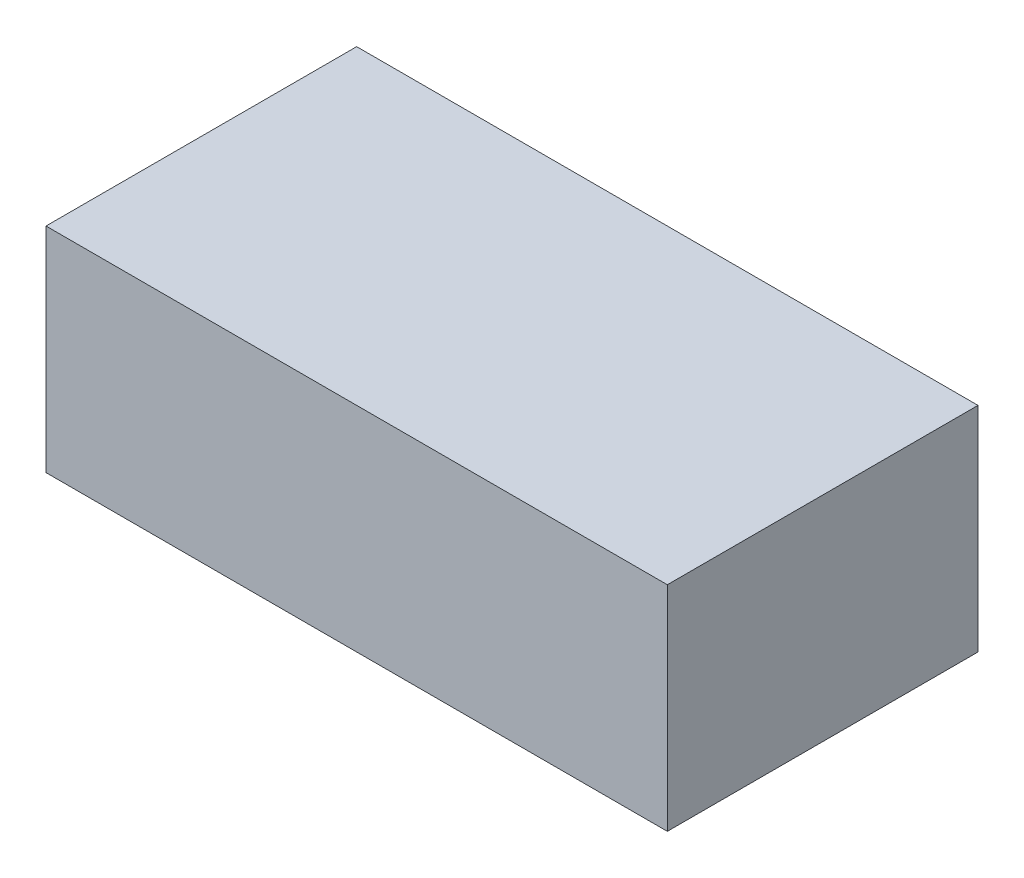
ISO-10303-21;
HEADER;
FILE_DESCRIPTION(('STEP AP214'),'2;1');
FILE_NAME('part.step','',(''),(''),'','','');
FILE_SCHEMA(('AUTOMOTIVE_DESIGN { 1 0 10303 214 1 1 1 1 }'));
ENDSEC;
DATA;
#1=APPLICATION_CONTEXT('core data for automotive mechanical design processes');
#2=APPLICATION_PROTOCOL_DEFINITION('international standard','automotive_design',2000,#1);
#3=PRODUCT_CONTEXT('',#1,'mechanical');
#4=PRODUCT('Part','Part','',(#3));
#5=PRODUCT_RELATED_PRODUCT_CATEGORY('part','',(#4));
#6=PRODUCT_DEFINITION_FORMATION('','',#4);
#7=PRODUCT_DEFINITION_CONTEXT('part definition',#1,'design');
#8=PRODUCT_DEFINITION('design','',#6,#7);
#9=PRODUCT_DEFINITION_SHAPE('','',#8);
#10=(LENGTH_UNIT() NAMED_UNIT(*) SI_UNIT(.MILLI.,.METRE.));
#11=(NAMED_UNIT(*) PLANE_ANGLE_UNIT() SI_UNIT($,.RADIAN.));
#12=(NAMED_UNIT(*) SI_UNIT($,.STERADIAN.) SOLID_ANGLE_UNIT());
#13=UNCERTAINTY_MEASURE_WITH_UNIT(LENGTH_MEASURE(1.E-05),#10,'distance_accuracy_value','');
#14=(GEOMETRIC_REPRESENTATION_CONTEXT(3) GLOBAL_UNCERTAINTY_ASSIGNED_CONTEXT((#13)) GLOBAL_UNIT_ASSIGNED_CONTEXT((#10,
#11,#12)) REPRESENTATION_CONTEXT('',''));
#15=CARTESIAN_POINT('',(0.,0.,0.));
#16=DIRECTION('',(0.,0.,1.));
#17=DIRECTION('',(1.,0.,0.));
#18=AXIS2_PLACEMENT_3D('',#15,#16,#17);
#19=CARTESIAN_POINT('',(0.8,0.55,-0.4));
#20=DIRECTION('',(-1.,0.,0.));
#21=DIRECTION('',(0.,0.,1.));
#22=AXIS2_PLACEMENT_3D('',#19,#20,#21);
#23=PLANE('',#22);
#24=DIRECTION('',(0.,0.,-1.));
#25=VECTOR('',#24,1.);
#26=CARTESIAN_POINT('',(0.8,0.,-0.4));
#27=LINE('',#26,#25);
#28=CARTESIAN_POINT('',(0.8,0.,0.4));
#29=VERTEX_POINT('',#28);
#30=CARTESIAN_POINT('',(0.8,0.,-0.4));
#31=VERTEX_POINT('',#30);
#32=EDGE_CURVE('E100',#29,#31,#27,.T.);
#33=ORIENTED_EDGE('',*,*,#32,.T.);
#34=DIRECTION('',(0.,-1.,0.));
#35=VECTOR('',#34,1.);
#36=CARTESIAN_POINT('',(0.8,0.55,-0.4));
#37=LINE('',#36,#35);
#38=CARTESIAN_POINT('',(0.8,0.55,-0.4));
#39=VERTEX_POINT('',#38);
#40=EDGE_CURVE('E11',#39,#31,#37,.T.);
#41=ORIENTED_EDGE('',*,*,#40,.F.);
#42=DIRECTION('',(0.,0.,-1.));
#43=VECTOR('',#42,1.);
#44=CARTESIAN_POINT('',(0.8,0.55,-0.4));
#45=LINE('',#44,#43);
#46=CARTESIAN_POINT('',(0.8,0.55,0.4));
#47=VERTEX_POINT('',#46);
#48=EDGE_CURVE('E88',#47,#39,#45,.T.);
#49=ORIENTED_EDGE('',*,*,#48,.F.);
#50=DIRECTION('',(0.,-1.,0.));
#51=VECTOR('',#50,1.);
#52=CARTESIAN_POINT('',(0.8,0.55,0.4));
#53=LINE('',#52,#51);
#54=EDGE_CURVE('E96',#47,#29,#53,.T.);
#55=ORIENTED_EDGE('',*,*,#54,.T.);
#56=EDGE_LOOP('',(#33,#41,#49,#55));
#57=FACE_BOUND('',#56,.T.);
#58=ADVANCED_FACE('F37',(#57),#23,.F.);
#59=CARTESIAN_POINT('',(-0.8,0.55,-0.4));
#60=DIRECTION('',(0.,0.,1.));
#61=DIRECTION('',(1.,0.,0.));
#62=AXIS2_PLACEMENT_3D('',#59,#60,#61);
#63=PLANE('',#62);
#64=DIRECTION('',(-1.,0.,0.));
#65=VECTOR('',#64,1.);
#66=CARTESIAN_POINT('',(-0.8,0.,-0.4));
#67=LINE('',#66,#65);
#68=CARTESIAN_POINT('',(-0.8,0.,-0.4));
#69=VERTEX_POINT('',#68);
#70=EDGE_CURVE('E92',#31,#69,#67,.T.);
#71=ORIENTED_EDGE('',*,*,#70,.T.);
#72=DIRECTION('',(0.,-1.,0.));
#73=VECTOR('',#72,1.);
#74=CARTESIAN_POINT('',(-0.8,0.55,-0.4));
#75=LINE('',#74,#73);
#76=CARTESIAN_POINT('',(-0.8,0.55,-0.4));
#77=VERTEX_POINT('',#76);
#78=EDGE_CURVE('E45',#77,#69,#75,.T.);
#79=ORIENTED_EDGE('',*,*,#78,.F.);
#80=DIRECTION('',(-1.,0.,0.));
#81=VECTOR('',#80,1.);
#82=CARTESIAN_POINT('',(-0.8,0.55,-0.4));
#83=LINE('',#82,#81);
#84=EDGE_CURVE('E83',#39,#77,#83,.T.);
#85=ORIENTED_EDGE('',*,*,#84,.F.);
#86=ORIENTED_EDGE('',*,*,#40,.T.);
#87=EDGE_LOOP('',(#71,#79,#85,#86));
#88=FACE_BOUND('',#87,.T.);
#89=ADVANCED_FACE('F91',(#88),#63,.F.);
#90=CARTESIAN_POINT('',(-0.8,0.55,-0.4));
#91=DIRECTION('',(1.,0.,0.));
#92=DIRECTION('',(0.,0.,-1.));
#93=AXIS2_PLACEMENT_3D('',#90,#91,#92);
#94=PLANE('',#93);
#95=DIRECTION('',(0.,0.,1.));
#96=VECTOR('',#95,1.);
#97=CARTESIAN_POINT('',(-0.8,0.,-0.4));
#98=LINE('',#97,#96);
#99=CARTESIAN_POINT('',(-0.8,0.,0.4));
#100=VERTEX_POINT('',#99);
#101=EDGE_CURVE('E70',#69,#100,#98,.T.);
#102=ORIENTED_EDGE('',*,*,#101,.T.);
#103=DIRECTION('',(0.,-1.,0.));
#104=VECTOR('',#103,1.);
#105=CARTESIAN_POINT('',(-0.8,0.55,0.4));
#106=LINE('',#105,#104);
#107=CARTESIAN_POINT('',(-0.8,0.55,0.4));
#108=VERTEX_POINT('',#107);
#109=EDGE_CURVE('E93',#108,#100,#106,.T.);
#110=ORIENTED_EDGE('',*,*,#109,.F.);
#111=DIRECTION('',(0.,0.,1.));
#112=VECTOR('',#111,1.);
#113=CARTESIAN_POINT('',(-0.8,0.55,-0.4));
#114=LINE('',#113,#112);
#115=EDGE_CURVE('E86',#77,#108,#114,.T.);
#116=ORIENTED_EDGE('',*,*,#115,.F.);
#117=ORIENTED_EDGE('',*,*,#78,.T.);
#118=EDGE_LOOP('',(#102,#110,#116,#117));
#119=FACE_BOUND('',#118,.T.);
#120=ADVANCED_FACE('F94',(#119),#94,.F.);
#121=CARTESIAN_POINT('',(-0.8,0.55,0.4));
#122=DIRECTION('',(0.,0.,-1.));
#123=DIRECTION('',(-1.,0.,0.));
#124=AXIS2_PLACEMENT_3D('',#121,#122,#123);
#125=PLANE('',#124);
#126=DIRECTION('',(1.,0.,0.));
#127=VECTOR('',#126,1.);
#128=CARTESIAN_POINT('',(-0.8,0.,0.4));
#129=LINE('',#128,#127);
#130=EDGE_CURVE('E76',#100,#29,#129,.T.);
#131=ORIENTED_EDGE('',*,*,#130,.T.);
#132=ORIENTED_EDGE('',*,*,#54,.F.);
#133=DIRECTION('',(1.,0.,0.));
#134=VECTOR('',#133,1.);
#135=CARTESIAN_POINT('',(-0.8,0.55,0.4));
#136=LINE('',#135,#134);
#137=EDGE_CURVE('E53',#108,#47,#136,.T.);
#138=ORIENTED_EDGE('',*,*,#137,.F.);
#139=ORIENTED_EDGE('',*,*,#109,.T.);
#140=EDGE_LOOP('',(#131,#132,#138,#139));
#141=FACE_BOUND('',#140,.T.);
#142=ADVANCED_FACE('F107',(#141),#125,.F.);
#143=CARTESIAN_POINT('',(0.,0.55,0.));
#144=DIRECTION('',(0.,1.,0.));
#145=DIRECTION('',(0.,0.,1.));
#146=AXIS2_PLACEMENT_3D('',#143,#144,#145);
#147=PLANE('',#146);
#148=ORIENTED_EDGE('',*,*,#48,.T.);
#149=ORIENTED_EDGE('',*,*,#84,.T.);
#150=ORIENTED_EDGE('',*,*,#115,.T.);
#151=ORIENTED_EDGE('',*,*,#137,.T.);
#152=EDGE_LOOP('',(#148,#149,#150,#151));
#153=FACE_BOUND('',#152,.T.);
#154=ADVANCED_FACE('F84',(#153),#147,.T.);
#155=CARTESIAN_POINT('',(0.,0.,0.));
#156=DIRECTION('',(0.,1.,0.));
#157=DIRECTION('',(0.,0.,1.));
#158=AXIS2_PLACEMENT_3D('',#155,#156,#157);
#159=PLANE('',#158);
#160=ORIENTED_EDGE('',*,*,#32,.F.);
#161=ORIENTED_EDGE('',*,*,#130,.F.);
#162=ORIENTED_EDGE('',*,*,#101,.F.);
#163=ORIENTED_EDGE('',*,*,#70,.F.);
#164=EDGE_LOOP('',(#160,#161,#162,#163));
#165=FACE_BOUND('',#164,.T.);
#166=ADVANCED_FACE('F110',(#165),#159,.F.);
#167=CLOSED_SHELL('',(#58,#89,#120,#142,#154,#166));
#168=MANIFOLD_SOLID_BREP('B2',#167);
#169=ADVANCED_BREP_SHAPE_REPRESENTATION('',(#18,#168),#14);
#170=SHAPE_DEFINITION_REPRESENTATION(#9,#169);
ENDSEC;
END-ISO-10303-21;
